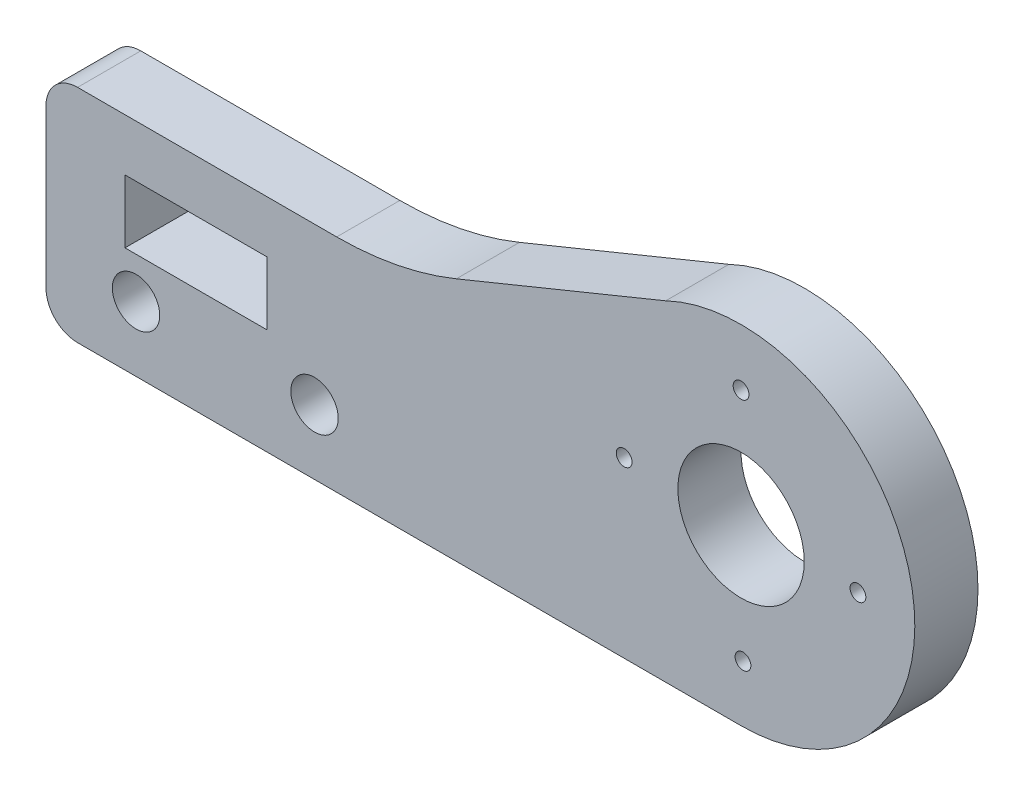
ISO-10303-21;
HEADER;
FILE_DESCRIPTION(('STEP AP214'),'2;1');
FILE_NAME('part.step','',(''),(''),'','','');
FILE_SCHEMA(('AUTOMOTIVE_DESIGN { 1 0 10303 214 1 1 1 1 }'));
ENDSEC;
DATA;
#1=APPLICATION_CONTEXT('core data for automotive mechanical design processes');
#2=APPLICATION_PROTOCOL_DEFINITION('international standard','automotive_design',2000,#1);
#3=PRODUCT_CONTEXT('',#1,'mechanical');
#4=PRODUCT('Part','Part','',(#3));
#5=PRODUCT_RELATED_PRODUCT_CATEGORY('part','',(#4));
#6=PRODUCT_DEFINITION_FORMATION('','',#4);
#7=PRODUCT_DEFINITION_CONTEXT('part definition',#1,'design');
#8=PRODUCT_DEFINITION('design','',#6,#7);
#9=PRODUCT_DEFINITION_SHAPE('','',#8);
#10=(LENGTH_UNIT() NAMED_UNIT(*) SI_UNIT(.MILLI.,.METRE.));
#11=(NAMED_UNIT(*) PLANE_ANGLE_UNIT() SI_UNIT($,.RADIAN.));
#12=(NAMED_UNIT(*) SI_UNIT($,.STERADIAN.) SOLID_ANGLE_UNIT());
#13=UNCERTAINTY_MEASURE_WITH_UNIT(LENGTH_MEASURE(1.E-05),#10,'distance_accuracy_value','');
#14=(GEOMETRIC_REPRESENTATION_CONTEXT(3) GLOBAL_UNCERTAINTY_ASSIGNED_CONTEXT((#13)) GLOBAL_UNIT_ASSIGNED_CONTEXT((#10,
#11,#12)) REPRESENTATION_CONTEXT('',''));
#15=CARTESIAN_POINT('',(0.,0.,0.));
#16=DIRECTION('',(0.,0.,1.));
#17=DIRECTION('',(1.,0.,0.));
#18=AXIS2_PLACEMENT_3D('',#15,#16,#17);
#19=CARTESIAN_POINT('',(4.,2.,4.));
#20=DIRECTION('',(0.,0.,1.));
#21=DIRECTION('',(1.,0.,0.));
#22=AXIS2_PLACEMENT_3D('',#19,#20,#21);
#23=PLANE('',#22);
#24=CARTESIAN_POINT('',(19.,4.1,4.));
#25=DIRECTION('',(0.,0.,1.));
#26=DIRECTION('',(1.,0.,0.));
#27=AXIS2_PLACEMENT_3D('',#24,#25,#26);
#28=CIRCLE('',#27,1.5);
#29=CARTESIAN_POINT('',(20.5,4.1,4.));
#30=VERTEX_POINT('',#29);
#31=EDGE_CURVE('E331',#30,#30,#28,.T.);
#32=ORIENTED_EDGE('',*,*,#31,.F.);
#33=EDGE_LOOP('',(#32));
#34=FACE_BOUND('',#33,.T.);
#35=CARTESIAN_POINT('',(53.4,11.,4.));
#36=DIRECTION('',(0.,0.,1.));
#37=DIRECTION('',(1.,0.,0.));
#38=AXIS2_PLACEMENT_3D('',#35,#36,#37);
#39=CIRCLE('',#38,0.5);
#40=CARTESIAN_POINT('',(53.9,11.,4.));
#41=VERTEX_POINT('',#40);
#42=EDGE_CURVE('E343',#41,#41,#39,.T.);
#43=ORIENTED_EDGE('',*,*,#42,.F.);
#44=EDGE_LOOP('',(#43));
#45=FACE_BOUND('',#44,.T.);
#46=CARTESIAN_POINT('',(46.,18.4,4.));
#47=DIRECTION('',(0.,0.,1.));
#48=DIRECTION('',(1.,0.,0.));
#49=AXIS2_PLACEMENT_3D('',#46,#47,#48);
#50=CIRCLE('',#49,0.5);
#51=CARTESIAN_POINT('',(46.5,18.4,4.));
#52=VERTEX_POINT('',#51);
#53=EDGE_CURVE('E355',#52,#52,#50,.T.);
#54=ORIENTED_EDGE('',*,*,#53,.F.);
#55=EDGE_LOOP('',(#54));
#56=FACE_BOUND('',#55,.T.);
#57=DIRECTION('',(1.,0.,0.));
#58=VECTOR('',#57,1.);
#59=CARTESIAN_POINT('',(16.,6.69999999999999,4.));
#60=LINE('',#59,#58);
#61=CARTESIAN_POINT('',(7.,6.69999999999999,4.));
#62=VERTEX_POINT('',#61);
#63=CARTESIAN_POINT('',(16.,6.69999999999999,4.));
#64=VERTEX_POINT('',#63);
#65=EDGE_CURVE('E129',#62,#64,#60,.T.);
#66=ORIENTED_EDGE('',*,*,#65,.F.);
#67=DIRECTION('',(0.,-1.,0.));
#68=VECTOR('',#67,1.);
#69=CARTESIAN_POINT('',(7.,10.7,4.));
#70=LINE('',#69,#68);
#71=CARTESIAN_POINT('',(7.,10.7,4.));
#72=VERTEX_POINT('',#71);
#73=EDGE_CURVE('E121',#72,#62,#70,.T.);
#74=ORIENTED_EDGE('',*,*,#73,.F.);
#75=DIRECTION('',(-1.,0.,0.));
#76=VECTOR('',#75,1.);
#77=CARTESIAN_POINT('',(7.,10.7,4.));
#78=LINE('',#77,#76);
#79=CARTESIAN_POINT('',(16.,10.7,4.));
#80=VERTEX_POINT('',#79);
#81=EDGE_CURVE('E144',#80,#72,#78,.T.);
#82=ORIENTED_EDGE('',*,*,#81,.F.);
#83=DIRECTION('',(0.,1.,0.));
#84=VECTOR('',#83,1.);
#85=CARTESIAN_POINT('',(16.,10.7,4.));
#86=LINE('',#85,#84);
#87=EDGE_CURVE('E142',#64,#80,#86,.T.);
#88=ORIENTED_EDGE('',*,*,#87,.F.);
#89=EDGE_LOOP('',(#66,#74,#82,#88));
#90=FACE_BOUND('',#89,.T.);
#91=CARTESIAN_POINT('',(4.,2.,4.));
#92=DIRECTION('',(0.,0.,1.));
#93=DIRECTION('',(1.,0.,0.));
#94=AXIS2_PLACEMENT_3D('',#91,#92,#93);
#95=CIRCLE('',#94,2.);
#96=CARTESIAN_POINT('',(2.,2.,4.));
#97=VERTEX_POINT('',#96);
#98=CARTESIAN_POINT('',(4.,0.,4.));
#99=VERTEX_POINT('',#98);
#100=EDGE_CURVE('E160',#97,#99,#95,.T.);
#101=ORIENTED_EDGE('',*,*,#100,.T.);
#102=DIRECTION('',(1.,0.,0.));
#103=VECTOR('',#102,1.);
#104=CARTESIAN_POINT('',(4.,0.,4.));
#105=LINE('',#104,#103);
#106=CARTESIAN_POINT('',(46.,0.,4.));
#107=VERTEX_POINT('',#106);
#108=EDGE_CURVE('E163',#99,#107,#105,.T.);
#109=ORIENTED_EDGE('',*,*,#108,.T.);
#110=CARTESIAN_POINT('',(46.,11.,4.));
#111=DIRECTION('',(0.,0.,1.));
#112=DIRECTION('',(1.,0.,0.));
#113=AXIS2_PLACEMENT_3D('',#110,#111,#112);
#114=CIRCLE('',#113,11.);
#115=CARTESIAN_POINT('',(41.2278217414321,20.9109189618547,4.));
#116=VERTEX_POINT('',#115);
#117=EDGE_CURVE('E166',#107,#116,#114,.T.);
#118=ORIENTED_EDGE('',*,*,#117,.T.);
#119=DIRECTION('',(-0.925553149998414,-0.378617704984876,0.));
#120=VECTOR('',#119,1.);
#121=CARTESIAN_POINT('',(27.9734693486925,15.4889370000317,4.));
#122=LINE('',#121,#120);
#123=CARTESIAN_POINT('',(27.9734693486925,15.4889370000317,4.));
#124=VERTEX_POINT('',#123);
#125=EDGE_CURVE('E168',#116,#124,#122,.T.);
#126=ORIENTED_EDGE('',*,*,#125,.T.);
#127=CARTESIAN_POINT('',(20.401115248995,34.,4.));
#128=DIRECTION('',(0.,0.,-1.));
#129=DIRECTION('',(1.,0.,0.));
#130=AXIS2_PLACEMENT_3D('',#127,#128,#129);
#131=CIRCLE('',#130,20.);
#132=CARTESIAN_POINT('',(20.401115248995,14.,4.));
#133=VERTEX_POINT('',#132);
#134=EDGE_CURVE('E170',#124,#133,#131,.T.);
#135=ORIENTED_EDGE('',*,*,#134,.T.);
#136=DIRECTION('',(-1.,0.,0.));
#137=VECTOR('',#136,1.);
#138=CARTESIAN_POINT('',(4.,14.,4.));
#139=LINE('',#138,#137);
#140=CARTESIAN_POINT('',(4.,14.,4.));
#141=VERTEX_POINT('',#140);
#142=EDGE_CURVE('E172',#133,#141,#139,.T.);
#143=ORIENTED_EDGE('',*,*,#142,.T.);
#144=CARTESIAN_POINT('',(4.,12.,4.));
#145=DIRECTION('',(0.,0.,1.));
#146=DIRECTION('',(1.,0.,0.));
#147=AXIS2_PLACEMENT_3D('',#144,#145,#146);
#148=CIRCLE('',#147,2.);
#149=CARTESIAN_POINT('',(2.,12.,4.));
#150=VERTEX_POINT('',#149);
#151=EDGE_CURVE('E174',#141,#150,#148,.T.);
#152=ORIENTED_EDGE('',*,*,#151,.T.);
#153=DIRECTION('',(0.,-1.,0.));
#154=VECTOR('',#153,1.);
#155=CARTESIAN_POINT('',(2.,2.,4.));
#156=LINE('',#155,#154);
#157=EDGE_CURVE('E176',#150,#97,#156,.T.);
#158=ORIENTED_EDGE('',*,*,#157,.T.);
#159=EDGE_LOOP('',(#101,#109,#118,#126,#135,#143,#152,#158));
#160=FACE_BOUND('',#159,.T.);
#161=CARTESIAN_POINT('',(46.,11.,4.));
#162=DIRECTION('',(0.,0.,1.));
#163=DIRECTION('',(1.,0.,0.));
#164=AXIS2_PLACEMENT_3D('',#161,#162,#163);
#165=CIRCLE('',#164,4.);
#166=CARTESIAN_POINT('',(50.,11.,4.));
#167=VERTEX_POINT('',#166);
#168=EDGE_CURVE('E150',#167,#167,#165,.T.);
#169=ORIENTED_EDGE('',*,*,#168,.F.);
#170=EDGE_LOOP('',(#169));
#171=FACE_BOUND('',#170,.T.);
#172=CARTESIAN_POINT('',(46.1210251621469,3.60098973442209,4.));
#173=DIRECTION('',(0.,0.,1.));
#174=DIRECTION('',(1.,0.,0.));
#175=AXIS2_PLACEMENT_3D('',#172,#173,#174);
#176=CIRCLE('',#175,0.5);
#177=CARTESIAN_POINT('',(46.6210251621469,3.60098973442209,4.));
#178=VERTEX_POINT('',#177);
#179=EDGE_CURVE('E349',#178,#178,#176,.T.);
#180=ORIENTED_EDGE('',*,*,#179,.F.);
#181=EDGE_LOOP('',(#180));
#182=FACE_BOUND('',#181,.T.);
#183=CARTESIAN_POINT('',(38.6,11.,4.));
#184=DIRECTION('',(0.,0.,1.));
#185=DIRECTION('',(1.,0.,0.));
#186=AXIS2_PLACEMENT_3D('',#183,#184,#185);
#187=CIRCLE('',#186,0.5);
#188=CARTESIAN_POINT('',(39.1,11.,4.));
#189=VERTEX_POINT('',#188);
#190=EDGE_CURVE('E337',#189,#189,#187,.T.);
#191=ORIENTED_EDGE('',*,*,#190,.F.);
#192=EDGE_LOOP('',(#191));
#193=FACE_BOUND('',#192,.T.);
#194=CARTESIAN_POINT('',(7.7,4.1,4.));
#195=DIRECTION('',(0.,0.,1.));
#196=DIRECTION('',(1.,0.,0.));
#197=AXIS2_PLACEMENT_3D('',#194,#195,#196);
#198=CIRCLE('',#197,1.5);
#199=CARTESIAN_POINT('',(9.2,4.1,4.));
#200=VERTEX_POINT('',#199);
#201=EDGE_CURVE('E322',#200,#200,#198,.T.);
#202=ORIENTED_EDGE('',*,*,#201,.F.);
#203=EDGE_LOOP('',(#202));
#204=FACE_BOUND('',#203,.T.);
#205=ADVANCED_FACE('F32',(#34,#45,#56,#90,#160,#171,#182,#193,#204),#23,.T.);
#206=CARTESIAN_POINT('',(4.,2.,0.));
#207=DIRECTION('',(0.,0.,1.));
#208=DIRECTION('',(1.,0.,0.));
#209=AXIS2_PLACEMENT_3D('',#206,#207,#208);
#210=PLANE('',#209);
#211=CARTESIAN_POINT('',(19.,4.1,0.));
#212=DIRECTION('',(0.,0.,1.));
#213=DIRECTION('',(1.,0.,0.));
#214=AXIS2_PLACEMENT_3D('',#211,#212,#213);
#215=CIRCLE('',#214,1.5);
#216=CARTESIAN_POINT('',(20.5,4.1,0.));
#217=VERTEX_POINT('',#216);
#218=EDGE_CURVE('E328',#217,#217,#215,.T.);
#219=ORIENTED_EDGE('',*,*,#218,.T.);
#220=EDGE_LOOP('',(#219));
#221=FACE_BOUND('',#220,.T.);
#222=CARTESIAN_POINT('',(53.4,11.,0.));
#223=DIRECTION('',(0.,0.,1.));
#224=DIRECTION('',(1.,0.,0.));
#225=AXIS2_PLACEMENT_3D('',#222,#223,#224);
#226=CIRCLE('',#225,0.5);
#227=CARTESIAN_POINT('',(53.9,11.,0.));
#228=VERTEX_POINT('',#227);
#229=EDGE_CURVE('E340',#228,#228,#226,.T.);
#230=ORIENTED_EDGE('',*,*,#229,.T.);
#231=EDGE_LOOP('',(#230));
#232=FACE_BOUND('',#231,.T.);
#233=CARTESIAN_POINT('',(46.,18.4,0.));
#234=DIRECTION('',(0.,0.,1.));
#235=DIRECTION('',(1.,0.,0.));
#236=AXIS2_PLACEMENT_3D('',#233,#234,#235);
#237=CIRCLE('',#236,0.5);
#238=CARTESIAN_POINT('',(46.5,18.4,0.));
#239=VERTEX_POINT('',#238);
#240=EDGE_CURVE('E352',#239,#239,#237,.T.);
#241=ORIENTED_EDGE('',*,*,#240,.T.);
#242=EDGE_LOOP('',(#241));
#243=FACE_BOUND('',#242,.T.);
#244=DIRECTION('',(0.,-1.,0.));
#245=VECTOR('',#244,1.);
#246=CARTESIAN_POINT('',(7.,10.7,0.));
#247=LINE('',#246,#245);
#248=CARTESIAN_POINT('',(7.,10.7,0.));
#249=VERTEX_POINT('',#248);
#250=CARTESIAN_POINT('',(7.,6.69999999999999,0.));
#251=VERTEX_POINT('',#250);
#252=EDGE_CURVE('E55',#249,#251,#247,.T.);
#253=ORIENTED_EDGE('',*,*,#252,.T.);
#254=DIRECTION('',(1.,0.,0.));
#255=VECTOR('',#254,1.);
#256=CARTESIAN_POINT('',(16.,6.69999999999999,0.));
#257=LINE('',#256,#255);
#258=CARTESIAN_POINT('',(16.,6.69999999999999,0.));
#259=VERTEX_POINT('',#258);
#260=EDGE_CURVE('E136',#251,#259,#257,.T.);
#261=ORIENTED_EDGE('',*,*,#260,.T.);
#262=DIRECTION('',(0.,1.,0.));
#263=VECTOR('',#262,1.);
#264=CARTESIAN_POINT('',(16.,10.7,0.));
#265=LINE('',#264,#263);
#266=CARTESIAN_POINT('',(16.,10.7,0.));
#267=VERTEX_POINT('',#266);
#268=EDGE_CURVE('E152',#259,#267,#265,.T.);
#269=ORIENTED_EDGE('',*,*,#268,.T.);
#270=DIRECTION('',(-1.,0.,0.));
#271=VECTOR('',#270,1.);
#272=CARTESIAN_POINT('',(7.,10.7,0.));
#273=LINE('',#272,#271);
#274=EDGE_CURVE('E130',#267,#249,#273,.T.);
#275=ORIENTED_EDGE('',*,*,#274,.T.);
#276=EDGE_LOOP('',(#253,#261,#269,#275));
#277=FACE_BOUND('',#276,.T.);
#278=CARTESIAN_POINT('',(4.,2.,0.));
#279=DIRECTION('',(0.,0.,1.));
#280=DIRECTION('',(1.,0.,0.));
#281=AXIS2_PLACEMENT_3D('',#278,#279,#280);
#282=CIRCLE('',#281,2.);
#283=CARTESIAN_POINT('',(2.,2.,0.));
#284=VERTEX_POINT('',#283);
#285=CARTESIAN_POINT('',(4.,0.,0.));
#286=VERTEX_POINT('',#285);
#287=EDGE_CURVE('E137',#284,#286,#282,.T.);
#288=ORIENTED_EDGE('',*,*,#287,.F.);
#289=DIRECTION('',(0.,-1.,0.));
#290=VECTOR('',#289,1.);
#291=CARTESIAN_POINT('',(2.,2.,0.));
#292=LINE('',#291,#290);
#293=CARTESIAN_POINT('',(2.,12.,0.));
#294=VERTEX_POINT('',#293);
#295=EDGE_CURVE('E164',#294,#284,#292,.T.);
#296=ORIENTED_EDGE('',*,*,#295,.F.);
#297=CARTESIAN_POINT('',(4.,12.,0.));
#298=DIRECTION('',(0.,0.,1.));
#299=DIRECTION('',(1.,0.,0.));
#300=AXIS2_PLACEMENT_3D('',#297,#298,#299);
#301=CIRCLE('',#300,2.);
#302=CARTESIAN_POINT('',(4.,14.,0.));
#303=VERTEX_POINT('',#302);
#304=EDGE_CURVE('E191',#303,#294,#301,.T.);
#305=ORIENTED_EDGE('',*,*,#304,.F.);
#306=DIRECTION('',(-1.,0.,0.));
#307=VECTOR('',#306,1.);
#308=CARTESIAN_POINT('',(4.,14.,0.));
#309=LINE('',#308,#307);
#310=CARTESIAN_POINT('',(20.401115248995,14.,0.));
#311=VERTEX_POINT('',#310);
#312=EDGE_CURVE('E189',#311,#303,#309,.T.);
#313=ORIENTED_EDGE('',*,*,#312,.F.);
#314=CARTESIAN_POINT('',(20.401115248995,34.,0.));
#315=DIRECTION('',(0.,0.,-1.));
#316=DIRECTION('',(1.,0.,0.));
#317=AXIS2_PLACEMENT_3D('',#314,#315,#316);
#318=CIRCLE('',#317,20.);
#319=CARTESIAN_POINT('',(27.9734693486925,15.4889370000317,0.));
#320=VERTEX_POINT('',#319);
#321=EDGE_CURVE('E187',#320,#311,#318,.T.);
#322=ORIENTED_EDGE('',*,*,#321,.F.);
#323=DIRECTION('',(-0.925553149998414,-0.378617704984876,0.));
#324=VECTOR('',#323,1.);
#325=CARTESIAN_POINT('',(27.9734693486925,15.4889370000317,0.));
#326=LINE('',#325,#324);
#327=CARTESIAN_POINT('',(41.2278217414321,20.9109189618547,0.));
#328=VERTEX_POINT('',#327);
#329=EDGE_CURVE('E185',#328,#320,#326,.T.);
#330=ORIENTED_EDGE('',*,*,#329,.F.);
#331=CARTESIAN_POINT('',(46.,11.,0.));
#332=DIRECTION('',(0.,0.,1.));
#333=DIRECTION('',(1.,0.,0.));
#334=AXIS2_PLACEMENT_3D('',#331,#332,#333);
#335=CIRCLE('',#334,11.);
#336=CARTESIAN_POINT('',(46.,0.,0.));
#337=VERTEX_POINT('',#336);
#338=EDGE_CURVE('E183',#337,#328,#335,.T.);
#339=ORIENTED_EDGE('',*,*,#338,.F.);
#340=DIRECTION('',(1.,0.,0.));
#341=VECTOR('',#340,1.);
#342=CARTESIAN_POINT('',(4.,0.,0.));
#343=LINE('',#342,#341);
#344=EDGE_CURVE('E181',#286,#337,#343,.T.);
#345=ORIENTED_EDGE('',*,*,#344,.F.);
#346=EDGE_LOOP('',(#288,#296,#305,#313,#322,#330,#339,#345));
#347=FACE_BOUND('',#346,.T.);
#348=CARTESIAN_POINT('',(46.,11.,0.));
#349=DIRECTION('',(0.,0.,1.));
#350=DIRECTION('',(1.,0.,0.));
#351=AXIS2_PLACEMENT_3D('',#348,#349,#350);
#352=CIRCLE('',#351,4.);
#353=CARTESIAN_POINT('',(50.,11.,0.));
#354=VERTEX_POINT('',#353);
#355=EDGE_CURVE('E358',#354,#354,#352,.T.);
#356=ORIENTED_EDGE('',*,*,#355,.T.);
#357=EDGE_LOOP('',(#356));
#358=FACE_BOUND('',#357,.T.);
#359=CARTESIAN_POINT('',(46.1210251621469,3.60098973442209,0.));
#360=DIRECTION('',(0.,0.,1.));
#361=DIRECTION('',(1.,0.,0.));
#362=AXIS2_PLACEMENT_3D('',#359,#360,#361);
#363=CIRCLE('',#362,0.5);
#364=CARTESIAN_POINT('',(46.6210251621469,3.60098973442209,0.));
#365=VERTEX_POINT('',#364);
#366=EDGE_CURVE('E346',#365,#365,#363,.T.);
#367=ORIENTED_EDGE('',*,*,#366,.T.);
#368=EDGE_LOOP('',(#367));
#369=FACE_BOUND('',#368,.T.);
#370=CARTESIAN_POINT('',(38.6,11.,0.));
#371=DIRECTION('',(0.,0.,1.));
#372=DIRECTION('',(1.,0.,0.));
#373=AXIS2_PLACEMENT_3D('',#370,#371,#372);
#374=CIRCLE('',#373,0.5);
#375=CARTESIAN_POINT('',(39.1,11.,0.));
#376=VERTEX_POINT('',#375);
#377=EDGE_CURVE('E334',#376,#376,#374,.T.);
#378=ORIENTED_EDGE('',*,*,#377,.T.);
#379=EDGE_LOOP('',(#378));
#380=FACE_BOUND('',#379,.T.);
#381=CARTESIAN_POINT('',(7.7,4.1,0.));
#382=DIRECTION('',(0.,0.,1.));
#383=DIRECTION('',(1.,0.,0.));
#384=AXIS2_PLACEMENT_3D('',#381,#382,#383);
#385=CIRCLE('',#384,1.5);
#386=CARTESIAN_POINT('',(9.2,4.1,0.));
#387=VERTEX_POINT('',#386);
#388=EDGE_CURVE('E325',#387,#387,#385,.T.);
#389=ORIENTED_EDGE('',*,*,#388,.T.);
#390=EDGE_LOOP('',(#389));
#391=FACE_BOUND('',#390,.T.);
#392=ADVANCED_FACE('F221',(#221,#232,#243,#277,#347,#358,#369,#380,#391),#210,.F.);
#393=CARTESIAN_POINT('',(4.,2.,4.));
#394=DIRECTION('',(0.,0.,-1.));
#395=DIRECTION('',(-1.,0.,0.));
#396=AXIS2_PLACEMENT_3D('',#393,#394,#395);
#397=CYLINDRICAL_SURFACE('',#396,2.);
#398=ORIENTED_EDGE('',*,*,#287,.T.);
#399=DIRECTION('',(0.,0.,-1.));
#400=VECTOR('',#399,1.);
#401=CARTESIAN_POINT('',(4.,0.,4.));
#402=LINE('',#401,#400);
#403=EDGE_CURVE('E11',#99,#286,#402,.T.);
#404=ORIENTED_EDGE('',*,*,#403,.F.);
#405=ORIENTED_EDGE('',*,*,#100,.F.);
#406=DIRECTION('',(0.,0.,-1.));
#407=VECTOR('',#406,1.);
#408=CARTESIAN_POINT('',(2.,2.,4.));
#409=LINE('',#408,#407);
#410=EDGE_CURVE('E178',#97,#284,#409,.T.);
#411=ORIENTED_EDGE('',*,*,#410,.T.);
#412=EDGE_LOOP('',(#398,#404,#405,#411));
#413=FACE_BOUND('',#412,.T.);
#414=ADVANCED_FACE('F34',(#413),#397,.T.);
#415=CARTESIAN_POINT('',(4.,0.,4.));
#416=DIRECTION('',(0.,1.,0.));
#417=DIRECTION('',(0.,0.,1.));
#418=AXIS2_PLACEMENT_3D('',#415,#416,#417);
#419=PLANE('',#418);
#420=ORIENTED_EDGE('',*,*,#344,.T.);
#421=DIRECTION('',(0.,0.,-1.));
#422=VECTOR('',#421,1.);
#423=CARTESIAN_POINT('',(46.,0.,4.));
#424=LINE('',#423,#422);
#425=EDGE_CURVE('E40',#107,#337,#424,.T.);
#426=ORIENTED_EDGE('',*,*,#425,.F.);
#427=ORIENTED_EDGE('',*,*,#108,.F.);
#428=ORIENTED_EDGE('',*,*,#403,.T.);
#429=EDGE_LOOP('',(#420,#426,#427,#428));
#430=FACE_BOUND('',#429,.T.);
#431=ADVANCED_FACE('F238',(#430),#419,.F.);
#432=CARTESIAN_POINT('',(46.,11.,4.));
#433=DIRECTION('',(0.,0.,-1.));
#434=DIRECTION('',(-1.,0.,0.));
#435=AXIS2_PLACEMENT_3D('',#432,#433,#434);
#436=CYLINDRICAL_SURFACE('',#435,11.);
#437=ORIENTED_EDGE('',*,*,#338,.T.);
#438=DIRECTION('',(0.,0.,-1.));
#439=VECTOR('',#438,1.);
#440=CARTESIAN_POINT('',(41.2278217414321,20.9109189618547,4.));
#441=LINE('',#440,#439);
#442=EDGE_CURVE('E208',#116,#328,#441,.T.);
#443=ORIENTED_EDGE('',*,*,#442,.F.);
#444=ORIENTED_EDGE('',*,*,#117,.F.);
#445=ORIENTED_EDGE('',*,*,#425,.T.);
#446=EDGE_LOOP('',(#437,#443,#444,#445));
#447=FACE_BOUND('',#446,.T.);
#448=ADVANCED_FACE('F215',(#447),#436,.T.);
#449=CARTESIAN_POINT('',(27.9734693486925,15.4889370000317,4.));
#450=DIRECTION('',(0.378617704984875,-0.925553149998414,0.));
#451=DIRECTION('',(0.925553149998414,0.378617704984875,0.));
#452=AXIS2_PLACEMENT_3D('',#449,#450,#451);
#453=PLANE('',#452);
#454=ORIENTED_EDGE('',*,*,#329,.T.);
#455=DIRECTION('',(0.,0.,-1.));
#456=VECTOR('',#455,1.);
#457=CARTESIAN_POINT('',(27.9734693486925,15.4889370000317,4.));
#458=LINE('',#457,#456);
#459=EDGE_CURVE('E205',#124,#320,#458,.T.);
#460=ORIENTED_EDGE('',*,*,#459,.F.);
#461=ORIENTED_EDGE('',*,*,#125,.F.);
#462=ORIENTED_EDGE('',*,*,#442,.T.);
#463=EDGE_LOOP('',(#454,#460,#461,#462));
#464=FACE_BOUND('',#463,.T.);
#465=ADVANCED_FACE('F227',(#464),#453,.F.);
#466=CARTESIAN_POINT('',(20.401115248995,34.,4.));
#467=DIRECTION('',(0.,0.,-1.));
#468=DIRECTION('',(-1.,0.,0.));
#469=AXIS2_PLACEMENT_3D('',#466,#467,#468);
#470=CYLINDRICAL_SURFACE('',#469,20.);
#471=ORIENTED_EDGE('',*,*,#321,.T.);
#472=DIRECTION('',(0.,0.,-1.));
#473=VECTOR('',#472,1.);
#474=CARTESIAN_POINT('',(20.401115248995,14.,4.));
#475=LINE('',#474,#473);
#476=EDGE_CURVE('E202',#133,#311,#475,.T.);
#477=ORIENTED_EDGE('',*,*,#476,.F.);
#478=ORIENTED_EDGE('',*,*,#134,.F.);
#479=ORIENTED_EDGE('',*,*,#459,.T.);
#480=EDGE_LOOP('',(#471,#477,#478,#479));
#481=FACE_BOUND('',#480,.T.);
#482=ADVANCED_FACE('F231',(#481),#470,.F.);
#483=CARTESIAN_POINT('',(4.,14.,4.));
#484=DIRECTION('',(0.,-1.,0.));
#485=DIRECTION('',(0.,0.,-1.));
#486=AXIS2_PLACEMENT_3D('',#483,#484,#485);
#487=PLANE('',#486);
#488=ORIENTED_EDGE('',*,*,#312,.T.);
#489=DIRECTION('',(0.,0.,-1.));
#490=VECTOR('',#489,1.);
#491=CARTESIAN_POINT('',(4.,14.,4.));
#492=LINE('',#491,#490);
#493=EDGE_CURVE('E199',#141,#303,#492,.T.);
#494=ORIENTED_EDGE('',*,*,#493,.F.);
#495=ORIENTED_EDGE('',*,*,#142,.F.);
#496=ORIENTED_EDGE('',*,*,#476,.T.);
#497=EDGE_LOOP('',(#488,#494,#495,#496));
#498=FACE_BOUND('',#497,.T.);
#499=ADVANCED_FACE('F251',(#498),#487,.F.);
#500=CARTESIAN_POINT('',(4.,12.,4.));
#501=DIRECTION('',(0.,0.,-1.));
#502=DIRECTION('',(-1.,0.,0.));
#503=AXIS2_PLACEMENT_3D('',#500,#501,#502);
#504=CYLINDRICAL_SURFACE('',#503,2.);
#505=ORIENTED_EDGE('',*,*,#304,.T.);
#506=DIRECTION('',(0.,0.,-1.));
#507=VECTOR('',#506,1.);
#508=CARTESIAN_POINT('',(2.,12.,4.));
#509=LINE('',#508,#507);
#510=EDGE_CURVE('E196',#150,#294,#509,.T.);
#511=ORIENTED_EDGE('',*,*,#510,.F.);
#512=ORIENTED_EDGE('',*,*,#151,.F.);
#513=ORIENTED_EDGE('',*,*,#493,.T.);
#514=EDGE_LOOP('',(#505,#511,#512,#513));
#515=FACE_BOUND('',#514,.T.);
#516=ADVANCED_FACE('F249',(#515),#504,.T.);
#517=CARTESIAN_POINT('',(2.,2.,4.));
#518=DIRECTION('',(1.,0.,0.));
#519=DIRECTION('',(0.,0.,-1.));
#520=AXIS2_PLACEMENT_3D('',#517,#518,#519);
#521=PLANE('',#520);
#522=ORIENTED_EDGE('',*,*,#295,.T.);
#523=ORIENTED_EDGE('',*,*,#410,.F.);
#524=ORIENTED_EDGE('',*,*,#157,.F.);
#525=ORIENTED_EDGE('',*,*,#510,.T.);
#526=EDGE_LOOP('',(#522,#523,#524,#525));
#527=FACE_BOUND('',#526,.T.);
#528=ADVANCED_FACE('F244',(#527),#521,.F.);
#529=CARTESIAN_POINT('',(7.,10.7,4.));
#530=DIRECTION('',(1.,0.,0.));
#531=DIRECTION('',(0.,0.,-1.));
#532=AXIS2_PLACEMENT_3D('',#529,#530,#531);
#533=PLANE('',#532);
#534=ORIENTED_EDGE('',*,*,#252,.F.);
#535=DIRECTION('',(0.,0.,-1.));
#536=VECTOR('',#535,1.);
#537=CARTESIAN_POINT('',(7.,10.7,4.));
#538=LINE('',#537,#536);
#539=EDGE_CURVE('E125',#72,#249,#538,.T.);
#540=ORIENTED_EDGE('',*,*,#539,.F.);
#541=ORIENTED_EDGE('',*,*,#73,.T.);
#542=DIRECTION('',(0.,0.,-1.));
#543=VECTOR('',#542,1.);
#544=CARTESIAN_POINT('',(7.,6.69999999999999,4.));
#545=LINE('',#544,#543);
#546=EDGE_CURVE('E124',#62,#251,#545,.T.);
#547=ORIENTED_EDGE('',*,*,#546,.T.);
#548=EDGE_LOOP('',(#534,#540,#541,#547));
#549=FACE_BOUND('',#548,.T.);
#550=ADVANCED_FACE('F123',(#549),#533,.T.);
#551=CARTESIAN_POINT('',(16.,6.69999999999999,4.));
#552=DIRECTION('',(0.,1.,0.));
#553=DIRECTION('',(0.,0.,1.));
#554=AXIS2_PLACEMENT_3D('',#551,#552,#553);
#555=PLANE('',#554);
#556=ORIENTED_EDGE('',*,*,#260,.F.);
#557=ORIENTED_EDGE('',*,*,#546,.F.);
#558=ORIENTED_EDGE('',*,*,#65,.T.);
#559=DIRECTION('',(0.,0.,-1.));
#560=VECTOR('',#559,1.);
#561=CARTESIAN_POINT('',(16.,6.69999999999999,4.));
#562=LINE('',#561,#560);
#563=EDGE_CURVE('E138',#64,#259,#562,.T.);
#564=ORIENTED_EDGE('',*,*,#563,.T.);
#565=EDGE_LOOP('',(#556,#557,#558,#564));
#566=FACE_BOUND('',#565,.T.);
#567=ADVANCED_FACE('F133',(#566),#555,.T.);
#568=CARTESIAN_POINT('',(16.,10.7,4.));
#569=DIRECTION('',(-1.,0.,0.));
#570=DIRECTION('',(0.,0.,1.));
#571=AXIS2_PLACEMENT_3D('',#568,#569,#570);
#572=PLANE('',#571);
#573=ORIENTED_EDGE('',*,*,#268,.F.);
#574=ORIENTED_EDGE('',*,*,#563,.F.);
#575=ORIENTED_EDGE('',*,*,#87,.T.);
#576=DIRECTION('',(0.,0.,-1.));
#577=VECTOR('',#576,1.);
#578=CARTESIAN_POINT('',(16.,10.7,4.));
#579=LINE('',#578,#577);
#580=EDGE_CURVE('E47',#80,#267,#579,.T.);
#581=ORIENTED_EDGE('',*,*,#580,.T.);
#582=EDGE_LOOP('',(#573,#574,#575,#581));
#583=FACE_BOUND('',#582,.T.);
#584=ADVANCED_FACE('F280',(#583),#572,.T.);
#585=CARTESIAN_POINT('',(7.,10.7,4.));
#586=DIRECTION('',(0.,-1.,0.));
#587=DIRECTION('',(0.,0.,-1.));
#588=AXIS2_PLACEMENT_3D('',#585,#586,#587);
#589=PLANE('',#588);
#590=ORIENTED_EDGE('',*,*,#274,.F.);
#591=ORIENTED_EDGE('',*,*,#580,.F.);
#592=ORIENTED_EDGE('',*,*,#81,.T.);
#593=ORIENTED_EDGE('',*,*,#539,.T.);
#594=EDGE_LOOP('',(#590,#591,#592,#593));
#595=FACE_BOUND('',#594,.T.);
#596=ADVANCED_FACE('F284',(#595),#589,.T.);
#597=CARTESIAN_POINT('',(46.,11.,4.));
#598=DIRECTION('',(0.,0.,-1.));
#599=DIRECTION('',(-1.,0.,0.));
#600=AXIS2_PLACEMENT_3D('',#597,#598,#599);
#601=CYLINDRICAL_SURFACE('',#600,4.);
#602=ORIENTED_EDGE('',*,*,#168,.T.);
#603=EDGE_LOOP('',(#602));
#604=FACE_BOUND('',#603,.T.);
#605=ORIENTED_EDGE('',*,*,#355,.F.);
#606=EDGE_LOOP('',(#605));
#607=FACE_BOUND('',#606,.T.);
#608=ADVANCED_FACE('F290',(#604,#607),#601,.F.);
#609=CARTESIAN_POINT('',(46.,18.4,4.));
#610=DIRECTION('',(0.,0.,-1.));
#611=DIRECTION('',(-1.,0.,0.));
#612=AXIS2_PLACEMENT_3D('',#609,#610,#611);
#613=CYLINDRICAL_SURFACE('',#612,0.5);
#614=ORIENTED_EDGE('',*,*,#53,.T.);
#615=EDGE_LOOP('',(#614));
#616=FACE_BOUND('',#615,.T.);
#617=ORIENTED_EDGE('',*,*,#240,.F.);
#618=EDGE_LOOP('',(#617));
#619=FACE_BOUND('',#618,.T.);
#620=ADVANCED_FACE('F293',(#616,#619),#613,.F.);
#621=CARTESIAN_POINT('',(46.1210251621469,3.60098973442209,4.));
#622=DIRECTION('',(0.,0.,-1.));
#623=DIRECTION('',(-1.,0.,0.));
#624=AXIS2_PLACEMENT_3D('',#621,#622,#623);
#625=CYLINDRICAL_SURFACE('',#624,0.5);
#626=ORIENTED_EDGE('',*,*,#179,.T.);
#627=EDGE_LOOP('',(#626));
#628=FACE_BOUND('',#627,.T.);
#629=ORIENTED_EDGE('',*,*,#366,.F.);
#630=EDGE_LOOP('',(#629));
#631=FACE_BOUND('',#630,.T.);
#632=ADVANCED_FACE('F297',(#628,#631),#625,.F.);
#633=CARTESIAN_POINT('',(53.4,11.,4.));
#634=DIRECTION('',(0.,0.,-1.));
#635=DIRECTION('',(-1.,0.,0.));
#636=AXIS2_PLACEMENT_3D('',#633,#634,#635);
#637=CYLINDRICAL_SURFACE('',#636,0.5);
#638=ORIENTED_EDGE('',*,*,#42,.T.);
#639=EDGE_LOOP('',(#638));
#640=FACE_BOUND('',#639,.T.);
#641=ORIENTED_EDGE('',*,*,#229,.F.);
#642=EDGE_LOOP('',(#641));
#643=FACE_BOUND('',#642,.T.);
#644=ADVANCED_FACE('F301',(#640,#643),#637,.F.);
#645=CARTESIAN_POINT('',(38.6,11.,4.));
#646=DIRECTION('',(0.,0.,-1.));
#647=DIRECTION('',(-1.,0.,0.));
#648=AXIS2_PLACEMENT_3D('',#645,#646,#647);
#649=CYLINDRICAL_SURFACE('',#648,0.5);
#650=ORIENTED_EDGE('',*,*,#190,.T.);
#651=EDGE_LOOP('',(#650));
#652=FACE_BOUND('',#651,.T.);
#653=ORIENTED_EDGE('',*,*,#377,.F.);
#654=EDGE_LOOP('',(#653));
#655=FACE_BOUND('',#654,.T.);
#656=ADVANCED_FACE('F305',(#652,#655),#649,.F.);
#657=CARTESIAN_POINT('',(19.,4.1,4.));
#658=DIRECTION('',(0.,0.,-1.));
#659=DIRECTION('',(-1.,0.,0.));
#660=AXIS2_PLACEMENT_3D('',#657,#658,#659);
#661=CYLINDRICAL_SURFACE('',#660,1.5);
#662=ORIENTED_EDGE('',*,*,#31,.T.);
#663=EDGE_LOOP('',(#662));
#664=FACE_BOUND('',#663,.T.);
#665=ORIENTED_EDGE('',*,*,#218,.F.);
#666=EDGE_LOOP('',(#665));
#667=FACE_BOUND('',#666,.T.);
#668=ADVANCED_FACE('F309',(#664,#667),#661,.F.);
#669=CARTESIAN_POINT('',(7.7,4.1,4.));
#670=DIRECTION('',(0.,0.,-1.));
#671=DIRECTION('',(-1.,0.,0.));
#672=AXIS2_PLACEMENT_3D('',#669,#670,#671);
#673=CYLINDRICAL_SURFACE('',#672,1.5);
#674=ORIENTED_EDGE('',*,*,#201,.T.);
#675=EDGE_LOOP('',(#674));
#676=FACE_BOUND('',#675,.T.);
#677=ORIENTED_EDGE('',*,*,#388,.F.);
#678=EDGE_LOOP('',(#677));
#679=FACE_BOUND('',#678,.T.);
#680=ADVANCED_FACE('F313',(#676,#679),#673,.F.);
#681=CLOSED_SHELL('',(#205,#392,#414,#431,#448,#465,#482,#499,#516,#528,#550,#567,#584,#596,
#608,#620,#632,#644,#656,#668,#680));
#682=MANIFOLD_SOLID_BREP('B2',#681);
#683=ADVANCED_BREP_SHAPE_REPRESENTATION('',(#18,#682),#14);
#684=SHAPE_DEFINITION_REPRESENTATION(#9,#683);
ENDSEC;
END-ISO-10303-21;
